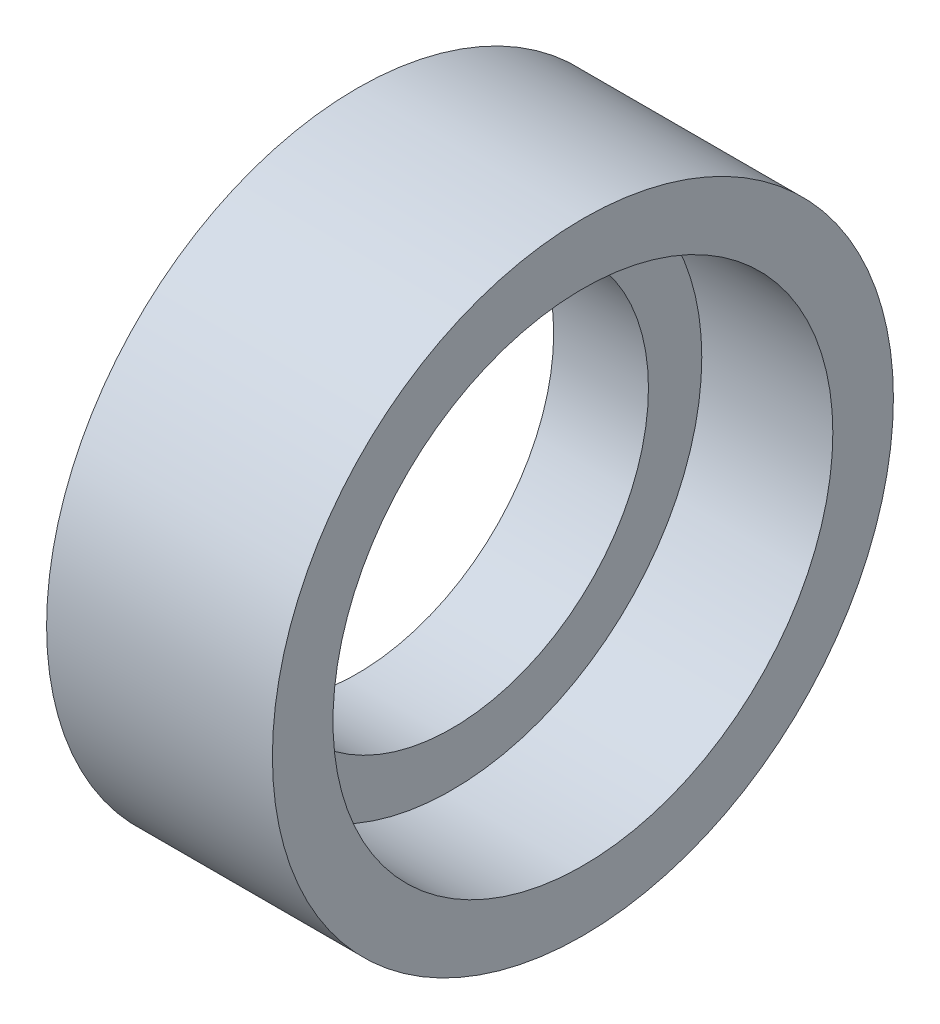
ISO-10303-21;
HEADER;
FILE_DESCRIPTION(('STEP AP214'),'2;1');
FILE_NAME('part.step','',(''),(''),'','','');
FILE_SCHEMA(('AUTOMOTIVE_DESIGN { 1 0 10303 214 1 1 1 1 }'));
ENDSEC;
DATA;
#1=APPLICATION_CONTEXT('core data for automotive mechanical design processes');
#2=APPLICATION_PROTOCOL_DEFINITION('international standard','automotive_design',2000,#1);
#3=PRODUCT_CONTEXT('',#1,'mechanical');
#4=PRODUCT('Part','Part','',(#3));
#5=PRODUCT_RELATED_PRODUCT_CATEGORY('part','',(#4));
#6=PRODUCT_DEFINITION_FORMATION('','',#4);
#7=PRODUCT_DEFINITION_CONTEXT('part definition',#1,'design');
#8=PRODUCT_DEFINITION('design','',#6,#7);
#9=PRODUCT_DEFINITION_SHAPE('','',#8);
#10=(LENGTH_UNIT() NAMED_UNIT(*) SI_UNIT(.MILLI.,.METRE.));
#11=(NAMED_UNIT(*) PLANE_ANGLE_UNIT() SI_UNIT($,.RADIAN.));
#12=(NAMED_UNIT(*) SI_UNIT($,.STERADIAN.) SOLID_ANGLE_UNIT());
#13=UNCERTAINTY_MEASURE_WITH_UNIT(LENGTH_MEASURE(1.E-05),#10,'distance_accuracy_value','');
#14=(GEOMETRIC_REPRESENTATION_CONTEXT(3) GLOBAL_UNCERTAINTY_ASSIGNED_CONTEXT((#13)) GLOBAL_UNIT_ASSIGNED_CONTEXT((#10,
#11,#12)) REPRESENTATION_CONTEXT('',''));
#15=CARTESIAN_POINT('',(0.,0.,0.));
#16=DIRECTION('',(0.,0.,1.));
#17=DIRECTION('',(1.,0.,0.));
#18=AXIS2_PLACEMENT_3D('',#15,#16,#17);
#19=CARTESIAN_POINT('',(11.75,0.,0.));
#20=DIRECTION('',(1.,0.,0.));
#21=DIRECTION('',(0.,1.,0.));
#22=AXIS2_PLACEMENT_3D('',#19,#20,#21);
#23=PLANE('',#22);
#24=CARTESIAN_POINT('',(11.75,0.,0.));
#25=DIRECTION('',(1.,0.,0.));
#26=DIRECTION('',(0.,0.,-1.));
#27=AXIS2_PLACEMENT_3D('',#24,#25,#26);
#28=CIRCLE('',#27,30.99);
#29=CARTESIAN_POINT('',(11.75,0.,-30.99));
#30=VERTEX_POINT('',#29);
#31=EDGE_CURVE('E11',#30,#30,#28,.T.);
#32=ORIENTED_EDGE('',*,*,#31,.T.);
#33=EDGE_LOOP('',(#32));
#34=FACE_BOUND('',#33,.T.);
#35=CARTESIAN_POINT('',(11.75,0.,0.));
#36=DIRECTION('',(1.,0.,0.));
#37=DIRECTION('',(0.,0.,-1.));
#38=AXIS2_PLACEMENT_3D('',#35,#36,#37);
#39=CIRCLE('',#38,24.376485);
#40=CARTESIAN_POINT('',(11.75,0.,-24.376485));
#41=VERTEX_POINT('',#40);
#42=EDGE_CURVE('E201',#41,#41,#39,.T.);
#43=ORIENTED_EDGE('',*,*,#42,.F.);
#44=EDGE_LOOP('',(#43));
#45=FACE_BOUND('',#44,.T.);
#46=ADVANCED_FACE('F16',(#34,#45),#23,.T.);
#47=CARTESIAN_POINT('',(11.75,0.,0.));
#48=DIRECTION('',(1.,0.,0.));
#49=DIRECTION('',(0.,0.,-1.));
#50=AXIS2_PLACEMENT_3D('',#47,#48,#49);
#51=CYLINDRICAL_SURFACE('',#50,30.99);
#52=CARTESIAN_POINT('',(28.,0.,0.));
#53=DIRECTION('',(1.,0.,0.));
#54=DIRECTION('',(0.,0.,-1.));
#55=AXIS2_PLACEMENT_3D('',#52,#53,#54);
#56=CIRCLE('',#55,30.99);
#57=CARTESIAN_POINT('',(28.,0.,-30.99));
#58=VERTEX_POINT('',#57);
#59=EDGE_CURVE('E194',#58,#58,#56,.T.);
#60=ORIENTED_EDGE('',*,*,#59,.T.);
#61=EDGE_LOOP('',(#60));
#62=FACE_BOUND('',#61,.T.);
#63=ORIENTED_EDGE('',*,*,#31,.F.);
#64=EDGE_LOOP('',(#63));
#65=FACE_BOUND('',#64,.T.);
#66=ADVANCED_FACE('F226',(#62,#65),#51,.F.);
#67=CARTESIAN_POINT('',(12.,0.,0.));
#68=DIRECTION('',(1.,0.,0.));
#69=DIRECTION('',(0.,1.,0.));
#70=AXIS2_PLACEMENT_3D('',#67,#68,#69);
#71=PLANE('',#70);
#72=CARTESIAN_POINT('',(12.,34.75,0.));
#73=DIRECTION('',(1.,0.,0.));
#74=DIRECTION('',(0.,0.,-1.));
#75=AXIS2_PLACEMENT_3D('',#72,#73,#74);
#76=CIRCLE('',#75,1.25);
#77=CARTESIAN_POINT('',(12.,34.75,-1.25));
#78=VERTEX_POINT('',#77);
#79=EDGE_CURVE('E27',#78,#78,#76,.T.);
#80=ORIENTED_EDGE('',*,*,#79,.F.);
#81=EDGE_LOOP('',(#80));
#82=FACE_BOUND('',#81,.T.);
#83=ADVANCED_FACE('F251',(#82),#71,.F.);
#84=CARTESIAN_POINT('',(12.,34.75,0.));
#85=DIRECTION('',(-1.,0.,0.));
#86=DIRECTION('',(0.,0.,1.));
#87=AXIS2_PLACEMENT_3D('',#84,#85,#86);
#88=CYLINDRICAL_SURFACE('',#87,1.25);
#89=CARTESIAN_POINT('',(0.,34.75,0.));
#90=DIRECTION('',(1.,0.,0.));
#91=DIRECTION('',(0.,0.,-1.));
#92=AXIS2_PLACEMENT_3D('',#89,#90,#91);
#93=CIRCLE('',#92,1.25);
#94=CARTESIAN_POINT('',(0.,34.75,-1.25));
#95=VERTEX_POINT('',#94);
#96=EDGE_CURVE('E191',#95,#95,#93,.T.);
#97=ORIENTED_EDGE('',*,*,#96,.F.);
#98=EDGE_LOOP('',(#97));
#99=FACE_BOUND('',#98,.T.);
#100=ORIENTED_EDGE('',*,*,#79,.T.);
#101=EDGE_LOOP('',(#100));
#102=FACE_BOUND('',#101,.T.);
#103=ADVANCED_FACE('F348',(#99,#102),#88,.F.);
#104=CARTESIAN_POINT('',(12.,0.,0.));
#105=DIRECTION('',(1.,0.,0.));
#106=DIRECTION('',(0.,1.,0.));
#107=AXIS2_PLACEMENT_3D('',#104,#105,#106);
#108=PLANE('',#107);
#109=CARTESIAN_POINT('',(12.,-21.666270614591,-27.168644015764));
#110=DIRECTION('',(1.,0.,0.));
#111=DIRECTION('',(0.,0.,-1.));
#112=AXIS2_PLACEMENT_3D('',#109,#110,#111);
#113=CIRCLE('',#112,1.25);
#114=CARTESIAN_POINT('',(12.,-21.666270614591,-28.418644015764));
#115=VERTEX_POINT('',#114);
#116=EDGE_CURVE('E195',#115,#115,#113,.T.);
#117=ORIENTED_EDGE('',*,*,#116,.F.);
#118=EDGE_LOOP('',(#117));
#119=FACE_BOUND('',#118,.T.);
#120=ADVANCED_FACE('F351',(#119),#108,.F.);
#121=CARTESIAN_POINT('',(12.,-21.666270614591,-27.168644015764));
#122=DIRECTION('',(-1.,0.,0.));
#123=DIRECTION('',(0.,0.,1.));
#124=AXIS2_PLACEMENT_3D('',#121,#122,#123);
#125=CYLINDRICAL_SURFACE('',#124,1.25);
#126=CARTESIAN_POINT('',(0.,-21.666270614591,-27.168644015764));
#127=DIRECTION('',(1.,0.,0.));
#128=DIRECTION('',(0.,0.,-1.));
#129=AXIS2_PLACEMENT_3D('',#126,#127,#128);
#130=CIRCLE('',#129,1.25);
#131=CARTESIAN_POINT('',(0.,-21.666270614591,-28.418644015764));
#132=VERTEX_POINT('',#131);
#133=EDGE_CURVE('E193',#132,#132,#130,.T.);
#134=ORIENTED_EDGE('',*,*,#133,.F.);
#135=EDGE_LOOP('',(#134));
#136=FACE_BOUND('',#135,.T.);
#137=ORIENTED_EDGE('',*,*,#116,.T.);
#138=EDGE_LOOP('',(#137));
#139=FACE_BOUND('',#138,.T.);
#140=ADVANCED_FACE('F360',(#136,#139),#125,.F.);
#141=CARTESIAN_POINT('',(12.,0.,0.));
#142=DIRECTION('',(1.,0.,0.));
#143=DIRECTION('',(0.,1.,0.));
#144=AXIS2_PLACEMENT_3D('',#141,#142,#143);
#145=PLANE('',#144);
#146=CARTESIAN_POINT('',(12.,-7.73260245498193,-33.8787449483183));
#147=DIRECTION('',(1.,0.,0.));
#148=DIRECTION('',(0.,0.,-1.));
#149=AXIS2_PLACEMENT_3D('',#146,#147,#148);
#150=CIRCLE('',#149,1.25);
#151=CARTESIAN_POINT('',(12.,-7.73260245498193,-35.1287449483184));
#152=VERTEX_POINT('',#151);
#153=EDGE_CURVE('E180',#152,#152,#150,.T.);
#154=ORIENTED_EDGE('',*,*,#153,.F.);
#155=EDGE_LOOP('',(#154));
#156=FACE_BOUND('',#155,.T.);
#157=ADVANCED_FACE('F357',(#156),#145,.F.);
#158=CARTESIAN_POINT('',(12.,-7.73260245498193,-33.8787449483183));
#159=DIRECTION('',(-1.,0.,0.));
#160=DIRECTION('',(0.,0.,1.));
#161=AXIS2_PLACEMENT_3D('',#158,#159,#160);
#162=CYLINDRICAL_SURFACE('',#161,1.25);
#163=CARTESIAN_POINT('',(0.,-7.73260245498193,-33.8787449483183));
#164=DIRECTION('',(1.,0.,0.));
#165=DIRECTION('',(0.,0.,-1.));
#166=AXIS2_PLACEMENT_3D('',#163,#164,#165);
#167=CIRCLE('',#166,1.25);
#168=CARTESIAN_POINT('',(0.,-7.73260245498193,-35.1287449483184));
#169=VERTEX_POINT('',#168);
#170=EDGE_CURVE('E214',#169,#169,#167,.T.);
#171=ORIENTED_EDGE('',*,*,#170,.F.);
#172=EDGE_LOOP('',(#171));
#173=FACE_BOUND('',#172,.T.);
#174=ORIENTED_EDGE('',*,*,#153,.T.);
#175=EDGE_LOOP('',(#174));
#176=FACE_BOUND('',#175,.T.);
#177=ADVANCED_FACE('F261',(#173,#176),#162,.F.);
#178=CARTESIAN_POINT('',(12.,0.,0.));
#179=DIRECTION('',(1.,0.,0.));
#180=DIRECTION('',(0.,1.,0.));
#181=AXIS2_PLACEMENT_3D('',#178,#179,#180);
#182=PLANE('',#181);
#183=CARTESIAN_POINT('',(12.,31.3086681596091,-15.0774599343352));
#184=DIRECTION('',(1.,0.,0.));
#185=DIRECTION('',(0.,0.,-1.));
#186=AXIS2_PLACEMENT_3D('',#183,#184,#185);
#187=CIRCLE('',#186,1.25);
#188=CARTESIAN_POINT('',(12.,31.3086681596091,-16.3274599343351));
#189=VERTEX_POINT('',#188);
#190=EDGE_CURVE('E176',#189,#189,#187,.T.);
#191=ORIENTED_EDGE('',*,*,#190,.F.);
#192=EDGE_LOOP('',(#191));
#193=FACE_BOUND('',#192,.T.);
#194=ADVANCED_FACE('F258',(#193),#182,.F.);
#195=CARTESIAN_POINT('',(12.,31.3086681596091,-15.0774599343352));
#196=DIRECTION('',(-1.,0.,0.));
#197=DIRECTION('',(0.,0.,1.));
#198=AXIS2_PLACEMENT_3D('',#195,#196,#197);
#199=CYLINDRICAL_SURFACE('',#198,1.25);
#200=CARTESIAN_POINT('',(0.,31.3086681596091,-15.0774599343352));
#201=DIRECTION('',(1.,0.,0.));
#202=DIRECTION('',(0.,0.,-1.));
#203=AXIS2_PLACEMENT_3D('',#200,#201,#202);
#204=CIRCLE('',#203,1.25);
#205=CARTESIAN_POINT('',(0.,31.3086681596091,-16.3274599343351));
#206=VERTEX_POINT('',#205);
#207=EDGE_CURVE('E219',#206,#206,#204,.T.);
#208=ORIENTED_EDGE('',*,*,#207,.F.);
#209=EDGE_LOOP('',(#208));
#210=FACE_BOUND('',#209,.T.);
#211=ORIENTED_EDGE('',*,*,#190,.T.);
#212=EDGE_LOOP('',(#211));
#213=FACE_BOUND('',#212,.T.);
#214=ADVANCED_FACE('F260',(#210,#213),#199,.F.);
#215=CARTESIAN_POINT('',(12.,0.,0.));
#216=DIRECTION('',(1.,0.,0.));
#217=DIRECTION('',(0.,1.,0.));
#218=AXIS2_PLACEMENT_3D('',#215,#216,#217);
#219=PLANE('',#218);
#220=CARTESIAN_POINT('',(12.,21.666270614591,-27.168644015764));
#221=DIRECTION('',(1.,0.,0.));
#222=DIRECTION('',(0.,0.,-1.));
#223=AXIS2_PLACEMENT_3D('',#220,#221,#222);
#224=CIRCLE('',#223,1.25);
#225=CARTESIAN_POINT('',(12.,21.666270614591,-28.418644015764));
#226=VERTEX_POINT('',#225);
#227=EDGE_CURVE('E181',#226,#226,#224,.T.);
#228=ORIENTED_EDGE('',*,*,#227,.F.);
#229=EDGE_LOOP('',(#228));
#230=FACE_BOUND('',#229,.T.);
#231=ADVANCED_FACE('F264',(#230),#219,.F.);
#232=CARTESIAN_POINT('',(12.,21.666270614591,-27.168644015764));
#233=DIRECTION('',(-1.,0.,0.));
#234=DIRECTION('',(0.,0.,1.));
#235=AXIS2_PLACEMENT_3D('',#232,#233,#234);
#236=CYLINDRICAL_SURFACE('',#235,1.25);
#237=CARTESIAN_POINT('',(0.,21.666270614591,-27.168644015764));
#238=DIRECTION('',(1.,0.,0.));
#239=DIRECTION('',(0.,0.,-1.));
#240=AXIS2_PLACEMENT_3D('',#237,#238,#239);
#241=CIRCLE('',#240,1.25);
#242=CARTESIAN_POINT('',(0.,21.666270614591,-28.418644015764));
#243=VERTEX_POINT('',#242);
#244=EDGE_CURVE('E221',#243,#243,#241,.T.);
#245=ORIENTED_EDGE('',*,*,#244,.F.);
#246=EDGE_LOOP('',(#245));
#247=FACE_BOUND('',#246,.T.);
#248=ORIENTED_EDGE('',*,*,#227,.T.);
#249=EDGE_LOOP('',(#248));
#250=FACE_BOUND('',#249,.T.);
#251=ADVANCED_FACE('F268',(#247,#250),#236,.F.);
#252=CARTESIAN_POINT('',(12.,0.,0.));
#253=DIRECTION('',(1.,0.,0.));
#254=DIRECTION('',(0.,1.,0.));
#255=AXIS2_PLACEMENT_3D('',#252,#253,#254);
#256=PLANE('',#255);
#257=CARTESIAN_POINT('',(12.,7.73260245498189,-33.8787449483184));
#258=DIRECTION('',(1.,0.,0.));
#259=DIRECTION('',(0.,0.,-1.));
#260=AXIS2_PLACEMENT_3D('',#257,#258,#259);
#261=CIRCLE('',#260,1.25);
#262=CARTESIAN_POINT('',(12.,7.73260245498189,-35.1287449483184));
#263=VERTEX_POINT('',#262);
#264=EDGE_CURVE('E218',#263,#263,#261,.T.);
#265=ORIENTED_EDGE('',*,*,#264,.F.);
#266=EDGE_LOOP('',(#265));
#267=FACE_BOUND('',#266,.T.);
#268=ADVANCED_FACE('F380',(#267),#256,.F.);
#269=CARTESIAN_POINT('',(12.,7.73260245498189,-33.8787449483184));
#270=DIRECTION('',(-1.,0.,0.));
#271=DIRECTION('',(0.,0.,1.));
#272=AXIS2_PLACEMENT_3D('',#269,#270,#271);
#273=CYLINDRICAL_SURFACE('',#272,1.25);
#274=CARTESIAN_POINT('',(0.,7.73260245498189,-33.8787449483184));
#275=DIRECTION('',(1.,0.,0.));
#276=DIRECTION('',(0.,0.,-1.));
#277=AXIS2_PLACEMENT_3D('',#274,#275,#276);
#278=CIRCLE('',#277,1.25);
#279=CARTESIAN_POINT('',(0.,7.73260245498189,-35.1287449483184));
#280=VERTEX_POINT('',#279);
#281=EDGE_CURVE('E186',#280,#280,#278,.T.);
#282=ORIENTED_EDGE('',*,*,#281,.F.);
#283=EDGE_LOOP('',(#282));
#284=FACE_BOUND('',#283,.T.);
#285=ORIENTED_EDGE('',*,*,#264,.T.);
#286=EDGE_LOOP('',(#285));
#287=FACE_BOUND('',#286,.T.);
#288=ADVANCED_FACE('F377',(#284,#287),#273,.F.);
#289=CARTESIAN_POINT('',(12.,0.,0.));
#290=DIRECTION('',(1.,0.,0.));
#291=DIRECTION('',(0.,1.,0.));
#292=AXIS2_PLACEMENT_3D('',#289,#290,#291);
#293=PLANE('',#292);
#294=CARTESIAN_POINT('',(12.,-31.308668159609,-15.0774599343352));
#295=DIRECTION('',(1.,0.,0.));
#296=DIRECTION('',(0.,0.,-1.));
#297=AXIS2_PLACEMENT_3D('',#294,#295,#296);
#298=CIRCLE('',#297,1.25);
#299=CARTESIAN_POINT('',(12.,-31.308668159609,-16.3274599343351));
#300=VERTEX_POINT('',#299);
#301=EDGE_CURVE('E300',#300,#300,#298,.T.);
#302=ORIENTED_EDGE('',*,*,#301,.F.);
#303=EDGE_LOOP('',(#302));
#304=FACE_BOUND('',#303,.T.);
#305=ADVANCED_FACE('F379',(#304),#293,.F.);
#306=CARTESIAN_POINT('',(12.,-31.308668159609,-15.0774599343352));
#307=DIRECTION('',(-1.,0.,0.));
#308=DIRECTION('',(0.,0.,1.));
#309=AXIS2_PLACEMENT_3D('',#306,#307,#308);
#310=CYLINDRICAL_SURFACE('',#309,1.25);
#311=CARTESIAN_POINT('',(0.,-31.308668159609,-15.0774599343352));
#312=DIRECTION('',(1.,0.,0.));
#313=DIRECTION('',(0.,0.,-1.));
#314=AXIS2_PLACEMENT_3D('',#311,#312,#313);
#315=CIRCLE('',#314,1.25);
#316=CARTESIAN_POINT('',(0.,-31.308668159609,-16.3274599343351));
#317=VERTEX_POINT('',#316);
#318=EDGE_CURVE('E182',#317,#317,#315,.T.);
#319=ORIENTED_EDGE('',*,*,#318,.F.);
#320=EDGE_LOOP('',(#319));
#321=FACE_BOUND('',#320,.T.);
#322=ORIENTED_EDGE('',*,*,#301,.T.);
#323=EDGE_LOOP('',(#322));
#324=FACE_BOUND('',#323,.T.);
#325=ADVANCED_FACE('F496',(#321,#324),#310,.F.);
#326=CARTESIAN_POINT('',(12.,0.,0.));
#327=DIRECTION('',(1.,0.,0.));
#328=DIRECTION('',(0.,1.,0.));
#329=AXIS2_PLACEMENT_3D('',#326,#327,#328);
#330=PLANE('',#329);
#331=CARTESIAN_POINT('',(12.,-34.75,0.));
#332=DIRECTION('',(1.,0.,0.));
#333=DIRECTION('',(0.,0.,-1.));
#334=AXIS2_PLACEMENT_3D('',#331,#332,#333);
#335=CIRCLE('',#334,1.25);
#336=CARTESIAN_POINT('',(12.,-34.75,-1.25));
#337=VERTEX_POINT('',#336);
#338=EDGE_CURVE('E174',#337,#337,#335,.T.);
#339=ORIENTED_EDGE('',*,*,#338,.F.);
#340=EDGE_LOOP('',(#339));
#341=FACE_BOUND('',#340,.T.);
#342=ADVANCED_FACE('F385',(#341),#330,.F.);
#343=CARTESIAN_POINT('',(12.,-34.75,0.));
#344=DIRECTION('',(-1.,0.,0.));
#345=DIRECTION('',(0.,0.,1.));
#346=AXIS2_PLACEMENT_3D('',#343,#344,#345);
#347=CYLINDRICAL_SURFACE('',#346,1.25);
#348=CARTESIAN_POINT('',(0.,-34.75,0.));
#349=DIRECTION('',(1.,0.,0.));
#350=DIRECTION('',(0.,0.,-1.));
#351=AXIS2_PLACEMENT_3D('',#348,#349,#350);
#352=CIRCLE('',#351,1.25);
#353=CARTESIAN_POINT('',(0.,-34.75,-1.25));
#354=VERTEX_POINT('',#353);
#355=EDGE_CURVE('E170',#354,#354,#352,.T.);
#356=ORIENTED_EDGE('',*,*,#355,.F.);
#357=EDGE_LOOP('',(#356));
#358=FACE_BOUND('',#357,.T.);
#359=ORIENTED_EDGE('',*,*,#338,.T.);
#360=EDGE_LOOP('',(#359));
#361=FACE_BOUND('',#360,.T.);
#362=ADVANCED_FACE('F305',(#358,#361),#347,.F.);
#363=CARTESIAN_POINT('',(12.,0.,0.));
#364=DIRECTION('',(1.,0.,0.));
#365=DIRECTION('',(0.,1.,0.));
#366=AXIS2_PLACEMENT_3D('',#363,#364,#365);
#367=PLANE('',#366);
#368=CARTESIAN_POINT('',(12.,-31.308668159609,15.0774599343352));
#369=DIRECTION('',(1.,0.,0.));
#370=DIRECTION('',(0.,0.,-1.));
#371=AXIS2_PLACEMENT_3D('',#368,#369,#370);
#372=CIRCLE('',#371,1.25);
#373=CARTESIAN_POINT('',(12.,-31.308668159609,13.8274599343352));
#374=VERTEX_POINT('',#373);
#375=EDGE_CURVE('E187',#374,#374,#372,.T.);
#376=ORIENTED_EDGE('',*,*,#375,.F.);
#377=EDGE_LOOP('',(#376));
#378=FACE_BOUND('',#377,.T.);
#379=ADVANCED_FACE('F256',(#378),#367,.F.);
#380=CARTESIAN_POINT('',(12.,-31.308668159609,15.0774599343352));
#381=DIRECTION('',(-1.,0.,0.));
#382=DIRECTION('',(0.,0.,1.));
#383=AXIS2_PLACEMENT_3D('',#380,#381,#382);
#384=CYLINDRICAL_SURFACE('',#383,1.25);
#385=CARTESIAN_POINT('',(0.,-31.308668159609,15.0774599343352));
#386=DIRECTION('',(1.,0.,0.));
#387=DIRECTION('',(0.,0.,-1.));
#388=AXIS2_PLACEMENT_3D('',#385,#386,#387);
#389=CIRCLE('',#388,1.25);
#390=CARTESIAN_POINT('',(0.,-31.308668159609,13.8274599343352));
#391=VERTEX_POINT('',#390);
#392=EDGE_CURVE('E161',#391,#391,#389,.T.);
#393=ORIENTED_EDGE('',*,*,#392,.F.);
#394=EDGE_LOOP('',(#393));
#395=FACE_BOUND('',#394,.T.);
#396=ORIENTED_EDGE('',*,*,#375,.T.);
#397=EDGE_LOOP('',(#396));
#398=FACE_BOUND('',#397,.T.);
#399=ADVANCED_FACE('F335',(#395,#398),#384,.F.);
#400=CARTESIAN_POINT('',(12.,0.,0.));
#401=DIRECTION('',(1.,0.,0.));
#402=DIRECTION('',(0.,1.,0.));
#403=AXIS2_PLACEMENT_3D('',#400,#401,#402);
#404=PLANE('',#403);
#405=CARTESIAN_POINT('',(12.,-21.666270614591,27.168644015764));
#406=DIRECTION('',(1.,0.,0.));
#407=DIRECTION('',(0.,0.,-1.));
#408=AXIS2_PLACEMENT_3D('',#405,#406,#407);
#409=CIRCLE('',#408,1.25);
#410=CARTESIAN_POINT('',(12.,-21.666270614591,25.918644015764));
#411=VERTEX_POINT('',#410);
#412=EDGE_CURVE('E190',#411,#411,#409,.T.);
#413=ORIENTED_EDGE('',*,*,#412,.F.);
#414=EDGE_LOOP('',(#413));
#415=FACE_BOUND('',#414,.T.);
#416=ADVANCED_FACE('F333',(#415),#404,.F.);
#417=CARTESIAN_POINT('',(12.,-21.666270614591,27.168644015764));
#418=DIRECTION('',(-1.,0.,0.));
#419=DIRECTION('',(0.,0.,1.));
#420=AXIS2_PLACEMENT_3D('',#417,#418,#419);
#421=CYLINDRICAL_SURFACE('',#420,1.25);
#422=CARTESIAN_POINT('',(0.,-21.666270614591,27.168644015764));
#423=DIRECTION('',(1.,0.,0.));
#424=DIRECTION('',(0.,0.,-1.));
#425=AXIS2_PLACEMENT_3D('',#422,#423,#424);
#426=CIRCLE('',#425,1.25);
#427=CARTESIAN_POINT('',(0.,-21.666270614591,25.918644015764));
#428=VERTEX_POINT('',#427);
#429=EDGE_CURVE('E151',#428,#428,#426,.T.);
#430=ORIENTED_EDGE('',*,*,#429,.F.);
#431=EDGE_LOOP('',(#430));
#432=FACE_BOUND('',#431,.T.);
#433=ORIENTED_EDGE('',*,*,#412,.T.);
#434=EDGE_LOOP('',(#433));
#435=FACE_BOUND('',#434,.T.);
#436=ADVANCED_FACE('F331',(#432,#435),#421,.F.);
#437=CARTESIAN_POINT('',(12.,0.,0.));
#438=DIRECTION('',(1.,0.,0.));
#439=DIRECTION('',(0.,1.,0.));
#440=AXIS2_PLACEMENT_3D('',#437,#438,#439);
#441=PLANE('',#440);
#442=CARTESIAN_POINT('',(12.,-7.73260245498192,33.8787449483183));
#443=DIRECTION('',(1.,0.,0.));
#444=DIRECTION('',(0.,0.,-1.));
#445=AXIS2_PLACEMENT_3D('',#442,#443,#444);
#446=CIRCLE('',#445,1.25);
#447=CARTESIAN_POINT('',(12.,-7.73260245498192,32.6287449483183));
#448=VERTEX_POINT('',#447);
#449=EDGE_CURVE('E141',#448,#448,#446,.T.);
#450=ORIENTED_EDGE('',*,*,#449,.F.);
#451=EDGE_LOOP('',(#450));
#452=FACE_BOUND('',#451,.T.);
#453=ADVANCED_FACE('F340',(#452),#441,.F.);
#454=CARTESIAN_POINT('',(12.,-7.73260245498192,33.8787449483183));
#455=DIRECTION('',(-1.,0.,0.));
#456=DIRECTION('',(0.,0.,1.));
#457=AXIS2_PLACEMENT_3D('',#454,#455,#456);
#458=CYLINDRICAL_SURFACE('',#457,1.25);
#459=CARTESIAN_POINT('',(0.,-7.73260245498192,33.8787449483183));
#460=DIRECTION('',(1.,0.,0.));
#461=DIRECTION('',(0.,0.,-1.));
#462=AXIS2_PLACEMENT_3D('',#459,#460,#461);
#463=CIRCLE('',#462,1.25);
#464=CARTESIAN_POINT('',(0.,-7.73260245498192,32.6287449483183));
#465=VERTEX_POINT('',#464);
#466=EDGE_CURVE('E147',#465,#465,#463,.T.);
#467=ORIENTED_EDGE('',*,*,#466,.F.);
#468=EDGE_LOOP('',(#467));
#469=FACE_BOUND('',#468,.T.);
#470=ORIENTED_EDGE('',*,*,#449,.T.);
#471=EDGE_LOOP('',(#470));
#472=FACE_BOUND('',#471,.T.);
#473=ADVANCED_FACE('F364',(#469,#472),#458,.F.);
#474=CARTESIAN_POINT('',(12.,0.,0.));
#475=DIRECTION('',(1.,0.,0.));
#476=DIRECTION('',(0.,1.,0.));
#477=AXIS2_PLACEMENT_3D('',#474,#475,#476);
#478=PLANE('',#477);
#479=CARTESIAN_POINT('',(12.,7.73260245498193,33.8787449483184));
#480=DIRECTION('',(1.,0.,0.));
#481=DIRECTION('',(0.,0.,-1.));
#482=AXIS2_PLACEMENT_3D('',#479,#480,#481);
#483=CIRCLE('',#482,1.25);
#484=CARTESIAN_POINT('',(12.,7.73260245498193,32.6287449483184));
#485=VERTEX_POINT('',#484);
#486=EDGE_CURVE('E20',#485,#485,#483,.T.);
#487=ORIENTED_EDGE('',*,*,#486,.F.);
#488=EDGE_LOOP('',(#487));
#489=FACE_BOUND('',#488,.T.);
#490=ADVANCED_FACE('F362',(#489),#478,.F.);
#491=CARTESIAN_POINT('',(12.,7.73260245498193,33.8787449483184));
#492=DIRECTION('',(-1.,0.,0.));
#493=DIRECTION('',(0.,0.,1.));
#494=AXIS2_PLACEMENT_3D('',#491,#492,#493);
#495=CYLINDRICAL_SURFACE('',#494,1.25);
#496=CARTESIAN_POINT('',(0.,7.73260245498193,33.8787449483184));
#497=DIRECTION('',(1.,0.,0.));
#498=DIRECTION('',(0.,0.,-1.));
#499=AXIS2_PLACEMENT_3D('',#496,#497,#498);
#500=CIRCLE('',#499,1.25);
#501=CARTESIAN_POINT('',(0.,7.73260245498193,32.6287449483184));
#502=VERTEX_POINT('',#501);
#503=EDGE_CURVE('E150',#502,#502,#500,.T.);
#504=ORIENTED_EDGE('',*,*,#503,.F.);
#505=EDGE_LOOP('',(#504));
#506=FACE_BOUND('',#505,.T.);
#507=ORIENTED_EDGE('',*,*,#486,.T.);
#508=EDGE_LOOP('',(#507));
#509=FACE_BOUND('',#508,.T.);
#510=ADVANCED_FACE('F356',(#506,#509),#495,.F.);
#511=CARTESIAN_POINT('',(12.,0.,0.));
#512=DIRECTION('',(1.,0.,0.));
#513=DIRECTION('',(0.,1.,0.));
#514=AXIS2_PLACEMENT_3D('',#511,#512,#513);
#515=PLANE('',#514);
#516=CARTESIAN_POINT('',(12.,21.666270614591,27.168644015764));
#517=DIRECTION('',(1.,0.,0.));
#518=DIRECTION('',(0.,0.,-1.));
#519=AXIS2_PLACEMENT_3D('',#516,#517,#518);
#520=CIRCLE('',#519,1.25);
#521=CARTESIAN_POINT('',(12.,21.666270614591,25.918644015764));
#522=VERTEX_POINT('',#521);
#523=EDGE_CURVE('E130',#522,#522,#520,.T.);
#524=ORIENTED_EDGE('',*,*,#523,.F.);
#525=EDGE_LOOP('',(#524));
#526=FACE_BOUND('',#525,.T.);
#527=ADVANCED_FACE('F353',(#526),#515,.F.);
#528=CARTESIAN_POINT('',(12.,21.666270614591,27.168644015764));
#529=DIRECTION('',(-1.,0.,0.));
#530=DIRECTION('',(0.,0.,1.));
#531=AXIS2_PLACEMENT_3D('',#528,#529,#530);
#532=CYLINDRICAL_SURFACE('',#531,1.25);
#533=CARTESIAN_POINT('',(0.,21.666270614591,27.168644015764));
#534=DIRECTION('',(1.,0.,0.));
#535=DIRECTION('',(0.,0.,-1.));
#536=AXIS2_PLACEMENT_3D('',#533,#534,#535);
#537=CIRCLE('',#536,1.25);
#538=CARTESIAN_POINT('',(0.,21.666270614591,25.918644015764));
#539=VERTEX_POINT('',#538);
#540=EDGE_CURVE('E158',#539,#539,#537,.T.);
#541=ORIENTED_EDGE('',*,*,#540,.F.);
#542=EDGE_LOOP('',(#541));
#543=FACE_BOUND('',#542,.T.);
#544=ORIENTED_EDGE('',*,*,#523,.T.);
#545=EDGE_LOOP('',(#544));
#546=FACE_BOUND('',#545,.T.);
#547=ADVANCED_FACE('F131',(#543,#546),#532,.F.);
#548=CARTESIAN_POINT('',(12.,0.,0.));
#549=DIRECTION('',(1.,0.,0.));
#550=DIRECTION('',(0.,1.,0.));
#551=AXIS2_PLACEMENT_3D('',#548,#549,#550);
#552=PLANE('',#551);
#553=CARTESIAN_POINT('',(12.,31.3086681596091,15.0774599343352));
#554=DIRECTION('',(1.,0.,0.));
#555=DIRECTION('',(0.,0.,-1.));
#556=AXIS2_PLACEMENT_3D('',#553,#554,#555);
#557=CIRCLE('',#556,1.25);
#558=CARTESIAN_POINT('',(12.,31.3086681596091,13.8274599343352));
#559=VERTEX_POINT('',#558);
#560=EDGE_CURVE('E134',#559,#559,#557,.T.);
#561=ORIENTED_EDGE('',*,*,#560,.F.);
#562=EDGE_LOOP('',(#561));
#563=FACE_BOUND('',#562,.T.);
#564=ADVANCED_FACE('F387',(#563),#552,.F.);
#565=CARTESIAN_POINT('',(12.,31.3086681596091,15.0774599343352));
#566=DIRECTION('',(-1.,0.,0.));
#567=DIRECTION('',(0.,0.,1.));
#568=AXIS2_PLACEMENT_3D('',#565,#566,#567);
#569=CYLINDRICAL_SURFACE('',#568,1.25);
#570=CARTESIAN_POINT('',(0.,31.3086681596091,15.0774599343352));
#571=DIRECTION('',(1.,0.,0.));
#572=DIRECTION('',(0.,0.,-1.));
#573=AXIS2_PLACEMENT_3D('',#570,#571,#572);
#574=CIRCLE('',#573,1.25);
#575=CARTESIAN_POINT('',(0.,31.3086681596091,13.8274599343352));
#576=VERTEX_POINT('',#575);
#577=EDGE_CURVE('E143',#576,#576,#574,.T.);
#578=ORIENTED_EDGE('',*,*,#577,.F.);
#579=EDGE_LOOP('',(#578));
#580=FACE_BOUND('',#579,.T.);
#581=ORIENTED_EDGE('',*,*,#560,.T.);
#582=EDGE_LOOP('',(#581));
#583=FACE_BOUND('',#582,.T.);
#584=ADVANCED_FACE('F243',(#580,#583),#569,.F.);
#585=CARTESIAN_POINT('',(0.,0.,0.));
#586=DIRECTION('',(1.,0.,0.));
#587=DIRECTION('',(0.,1.,0.));
#588=AXIS2_PLACEMENT_3D('',#585,#586,#587);
#589=PLANE('',#588);
#590=CARTESIAN_POINT('',(0.,0.,0.));
#591=DIRECTION('',(1.,0.,0.));
#592=DIRECTION('',(0.,0.,-1.));
#593=AXIS2_PLACEMENT_3D('',#590,#591,#592);
#594=CIRCLE('',#593,24.376485);
#595=CARTESIAN_POINT('',(0.,0.,-24.376485));
#596=VERTEX_POINT('',#595);
#597=EDGE_CURVE('E204',#596,#596,#594,.T.);
#598=ORIENTED_EDGE('',*,*,#597,.T.);
#599=EDGE_LOOP('',(#598));
#600=FACE_BOUND('',#599,.T.);
#601=CARTESIAN_POINT('',(0.,0.,0.));
#602=DIRECTION('',(1.,0.,0.));
#603=DIRECTION('',(0.,0.,-1.));
#604=AXIS2_PLACEMENT_3D('',#601,#602,#603);
#605=CIRCLE('',#604,38.5);
#606=CARTESIAN_POINT('',(0.,0.,-38.5));
#607=VERTEX_POINT('',#606);
#608=EDGE_CURVE('E207',#607,#607,#605,.T.);
#609=ORIENTED_EDGE('',*,*,#608,.F.);
#610=EDGE_LOOP('',(#609));
#611=FACE_BOUND('',#610,.T.);
#612=ORIENTED_EDGE('',*,*,#577,.T.);
#613=EDGE_LOOP('',(#612));
#614=FACE_BOUND('',#613,.T.);
#615=ORIENTED_EDGE('',*,*,#540,.T.);
#616=EDGE_LOOP('',(#615));
#617=FACE_BOUND('',#616,.T.);
#618=ORIENTED_EDGE('',*,*,#503,.T.);
#619=EDGE_LOOP('',(#618));
#620=FACE_BOUND('',#619,.T.);
#621=ORIENTED_EDGE('',*,*,#466,.T.);
#622=EDGE_LOOP('',(#621));
#623=FACE_BOUND('',#622,.T.);
#624=ORIENTED_EDGE('',*,*,#429,.T.);
#625=EDGE_LOOP('',(#624));
#626=FACE_BOUND('',#625,.T.);
#627=ORIENTED_EDGE('',*,*,#392,.T.);
#628=EDGE_LOOP('',(#627));
#629=FACE_BOUND('',#628,.T.);
#630=ORIENTED_EDGE('',*,*,#355,.T.);
#631=EDGE_LOOP('',(#630));
#632=FACE_BOUND('',#631,.T.);
#633=ORIENTED_EDGE('',*,*,#318,.T.);
#634=EDGE_LOOP('',(#633));
#635=FACE_BOUND('',#634,.T.);
#636=ORIENTED_EDGE('',*,*,#281,.T.);
#637=EDGE_LOOP('',(#636));
#638=FACE_BOUND('',#637,.T.);
#639=ORIENTED_EDGE('',*,*,#244,.T.);
#640=EDGE_LOOP('',(#639));
#641=FACE_BOUND('',#640,.T.);
#642=ORIENTED_EDGE('',*,*,#207,.T.);
#643=EDGE_LOOP('',(#642));
#644=FACE_BOUND('',#643,.T.);
#645=ORIENTED_EDGE('',*,*,#170,.T.);
#646=EDGE_LOOP('',(#645));
#647=FACE_BOUND('',#646,.T.);
#648=ORIENTED_EDGE('',*,*,#133,.T.);
#649=EDGE_LOOP('',(#648));
#650=FACE_BOUND('',#649,.T.);
#651=ORIENTED_EDGE('',*,*,#96,.T.);
#652=EDGE_LOOP('',(#651));
#653=FACE_BOUND('',#652,.T.);
#654=ADVANCED_FACE('F18',(#600,#611,#614,#617,#620,#623,#626,#629,#632,#635,#638,#641,#644,#647,
#650,#653),#589,.F.);
#655=CARTESIAN_POINT('',(28.,0.,0.));
#656=DIRECTION('',(1.,0.,0.));
#657=DIRECTION('',(0.,1.,0.));
#658=AXIS2_PLACEMENT_3D('',#655,#656,#657);
#659=PLANE('',#658);
#660=CARTESIAN_POINT('',(28.,0.,0.));
#661=DIRECTION('',(1.,0.,0.));
#662=DIRECTION('',(0.,0.,-1.));
#663=AXIS2_PLACEMENT_3D('',#660,#661,#662);
#664=CIRCLE('',#663,38.5);
#665=CARTESIAN_POINT('',(28.,0.,-38.5));
#666=VERTEX_POINT('',#665);
#667=EDGE_CURVE('E203',#666,#666,#664,.T.);
#668=ORIENTED_EDGE('',*,*,#667,.T.);
#669=EDGE_LOOP('',(#668));
#670=FACE_BOUND('',#669,.T.);
#671=ORIENTED_EDGE('',*,*,#59,.F.);
#672=EDGE_LOOP('',(#671));
#673=FACE_BOUND('',#672,.T.);
#674=ADVANCED_FACE('F231',(#670,#673),#659,.T.);
#675=CARTESIAN_POINT('',(28.,0.,0.));
#676=DIRECTION('',(-1.,0.,0.));
#677=DIRECTION('',(0.,0.,1.));
#678=AXIS2_PLACEMENT_3D('',#675,#676,#677);
#679=CYLINDRICAL_SURFACE('',#678,38.5);
#680=ORIENTED_EDGE('',*,*,#608,.T.);
#681=EDGE_LOOP('',(#680));
#682=FACE_BOUND('',#681,.T.);
#683=ORIENTED_EDGE('',*,*,#667,.F.);
#684=EDGE_LOOP('',(#683));
#685=FACE_BOUND('',#684,.T.);
#686=ADVANCED_FACE('F233',(#682,#685),#679,.T.);
#687=CARTESIAN_POINT('',(28.,0.,0.));
#688=DIRECTION('',(-1.,0.,0.));
#689=DIRECTION('',(0.,0.,1.));
#690=AXIS2_PLACEMENT_3D('',#687,#688,#689);
#691=CYLINDRICAL_SURFACE('',#690,24.376485);
#692=ORIENTED_EDGE('',*,*,#42,.T.);
#693=EDGE_LOOP('',(#692));
#694=FACE_BOUND('',#693,.T.);
#695=ORIENTED_EDGE('',*,*,#597,.F.);
#696=EDGE_LOOP('',(#695));
#697=FACE_BOUND('',#696,.T.);
#698=ADVANCED_FACE('F240',(#694,#697),#691,.F.);
#699=CLOSED_SHELL('',(#46,#66,#83,#103,#120,#140,#157,#177,#194,#214,#231,#251,#268,#288,#305,
#325,#342,#362,#379,#399,#416,#436,#453,#473,#490,#510,#527,#547,#564,#584,#654,#674,#686,#698));
#700=MANIFOLD_SOLID_BREP('B1',#699);
#701=ADVANCED_BREP_SHAPE_REPRESENTATION('',(#18,#700),#14);
#702=SHAPE_DEFINITION_REPRESENTATION(#9,#701);
ENDSEC;
END-ISO-10303-21;
